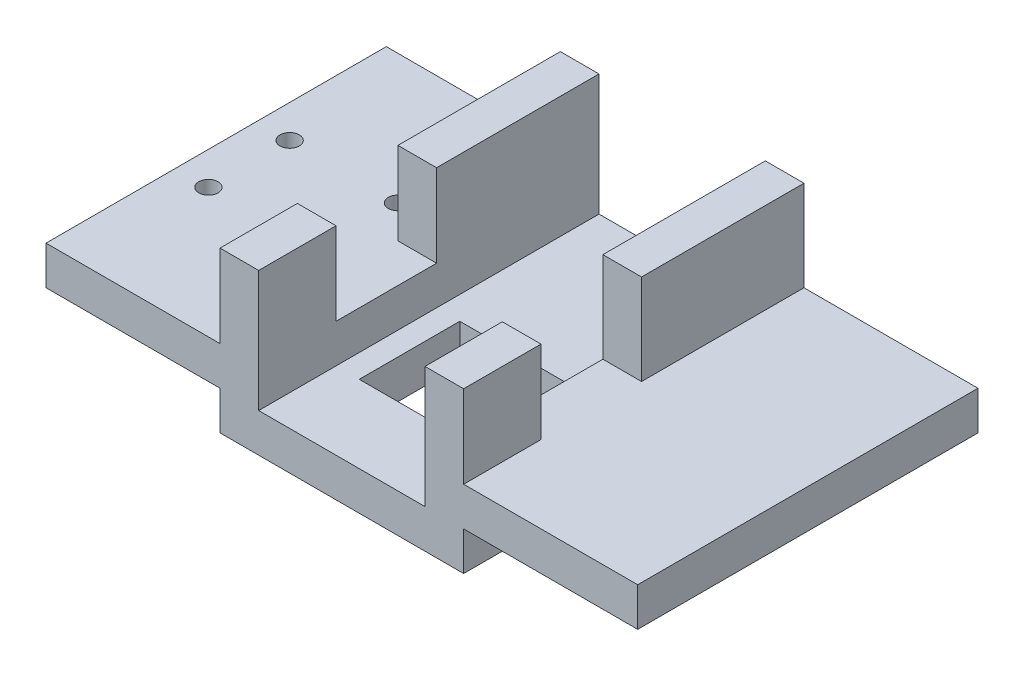
ISO-10303-21;
HEADER;
FILE_DESCRIPTION(('STEP AP214'),'2;1');
FILE_NAME('part.step','',(''),(''),'','','');
FILE_SCHEMA(('AUTOMOTIVE_DESIGN { 1 0 10303 214 1 1 1 1 }'));
ENDSEC;
DATA;
#1=APPLICATION_CONTEXT('core data for automotive mechanical design processes');
#2=APPLICATION_PROTOCOL_DEFINITION('international standard','automotive_design',2000,#1);
#3=PRODUCT_CONTEXT('',#1,'mechanical');
#4=PRODUCT('Part','Part','',(#3));
#5=PRODUCT_RELATED_PRODUCT_CATEGORY('part','',(#4));
#6=PRODUCT_DEFINITION_FORMATION('','',#4);
#7=PRODUCT_DEFINITION_CONTEXT('part definition',#1,'design');
#8=PRODUCT_DEFINITION('design','',#6,#7);
#9=PRODUCT_DEFINITION_SHAPE('','',#8);
#10=(LENGTH_UNIT() NAMED_UNIT(*) SI_UNIT(.MILLI.,.METRE.));
#11=(NAMED_UNIT(*) PLANE_ANGLE_UNIT() SI_UNIT($,.RADIAN.));
#12=(NAMED_UNIT(*) SI_UNIT($,.STERADIAN.) SOLID_ANGLE_UNIT());
#13=UNCERTAINTY_MEASURE_WITH_UNIT(LENGTH_MEASURE(1.E-05),#10,'distance_accuracy_value','');
#14=(GEOMETRIC_REPRESENTATION_CONTEXT(3) GLOBAL_UNCERTAINTY_ASSIGNED_CONTEXT((#13)) GLOBAL_UNIT_ASSIGNED_CONTEXT((#10,
#11,#12)) REPRESENTATION_CONTEXT('',''));
#15=CARTESIAN_POINT('',(0.,0.,0.));
#16=DIRECTION('',(0.,0.,1.));
#17=DIRECTION('',(1.,0.,0.));
#18=AXIS2_PLACEMENT_3D('',#15,#16,#17);
#19=CARTESIAN_POINT('',(0.,-25.5315237964784,42.));
#20=DIRECTION('',(0.,-1.,0.));
#21=DIRECTION('',(1.,0.,0.));
#22=AXIS2_PLACEMENT_3D('',#19,#20,#21);
#23=PLANE('',#22);
#24=CARTESIAN_POINT('',(-8.5,-25.5315237964784,54.5));
#25=DIRECTION('',(0.,-1.,0.));
#26=DIRECTION('',(1.,0.,0.));
#27=AXIS2_PLACEMENT_3D('',#24,#25,#26);
#28=CIRCLE('',#27,2.5);
#29=CARTESIAN_POINT('',(-5.99999999999999,-25.5315237964784,54.5));
#30=VERTEX_POINT('',#29);
#31=EDGE_CURVE('E645',#30,#30,#28,.T.);
#32=ORIENTED_EDGE('',*,*,#31,.T.);
#33=EDGE_LOOP('',(#32));
#34=FACE_BOUND('',#33,.T.);
#35=CARTESIAN_POINT('',(-8.5,-25.5315237964784,33.5));
#36=DIRECTION('',(0.,1.,0.));
#37=DIRECTION('',(-1.,0.,0.));
#38=AXIS2_PLACEMENT_3D('',#35,#36,#37);
#39=CIRCLE('',#38,2.5);
#40=CARTESIAN_POINT('',(-11.,-25.5315237964784,33.5));
#41=VERTEX_POINT('',#40);
#42=EDGE_CURVE('E601',#41,#41,#39,.T.);
#43=ORIENTED_EDGE('',*,*,#42,.F.);
#44=EDGE_LOOP('',(#43));
#45=FACE_BOUND('',#44,.T.);
#46=DIRECTION('',(0.,0.,1.));
#47=VECTOR('',#46,1.);
#48=CARTESIAN_POINT('',(0.,-25.5315237964784,88.));
#49=LINE('',#48,#47);
#50=CARTESIAN_POINT('',(0.,-25.5315237964784,68.));
#51=VERTEX_POINT('',#50);
#52=CARTESIAN_POINT('',(0.,-25.5315237964784,88.));
#53=VERTEX_POINT('',#52);
#54=EDGE_CURVE('E50',#51,#53,#49,.T.);
#55=ORIENTED_EDGE('',*,*,#54,.F.);
#56=DIRECTION('',(-1.,0.,0.));
#57=VECTOR('',#56,1.);
#58=CARTESIAN_POINT('',(10.,-25.5315237964784,68.));
#59=LINE('',#58,#57);
#60=CARTESIAN_POINT('',(10.,-25.5315237964784,68.));
#61=VERTEX_POINT('',#60);
#62=EDGE_CURVE('E268',#61,#51,#59,.T.);
#63=ORIENTED_EDGE('',*,*,#62,.F.);
#64=DIRECTION('',(0.,0.,-1.));
#65=VECTOR('',#64,1.);
#66=CARTESIAN_POINT('',(10.,-25.5315237964784,88.));
#67=LINE('',#66,#65);
#68=CARTESIAN_POINT('',(10.,-25.5315237964784,42.));
#69=VERTEX_POINT('',#68);
#70=EDGE_CURVE('E333',#61,#69,#67,.T.);
#71=ORIENTED_EDGE('',*,*,#70,.T.);
#72=DIRECTION('',(-1.,0.,0.));
#73=VECTOR('',#72,1.);
#74=CARTESIAN_POINT('',(-45.,-25.5315237964784,42.));
#75=LINE('',#74,#73);
#76=CARTESIAN_POINT('',(0.,-25.5315237964784,42.));
#77=VERTEX_POINT('',#76);
#78=EDGE_CURVE('E318',#69,#77,#75,.T.);
#79=ORIENTED_EDGE('',*,*,#78,.T.);
#80=DIRECTION('',(0.,0.,-1.));
#81=VECTOR('',#80,1.);
#82=CARTESIAN_POINT('',(0.,-25.5315237964784,42.));
#83=LINE('',#82,#81);
#84=CARTESIAN_POINT('',(0.,-25.5315237964784,0.));
#85=VERTEX_POINT('',#84);
#86=EDGE_CURVE('E11',#77,#85,#83,.T.);
#87=ORIENTED_EDGE('',*,*,#86,.T.);
#88=DIRECTION('',(-1.,0.,0.));
#89=VECTOR('',#88,1.);
#90=CARTESIAN_POINT('',(0.,-25.5315237964784,0.));
#91=LINE('',#90,#89);
#92=CARTESIAN_POINT('',(-45.,-25.5315237964784,0.));
#93=VERTEX_POINT('',#92);
#94=EDGE_CURVE('E441',#85,#93,#91,.T.);
#95=ORIENTED_EDGE('',*,*,#94,.T.);
#96=DIRECTION('',(0.,0.,-1.));
#97=VECTOR('',#96,1.);
#98=CARTESIAN_POINT('',(-45.,-25.5315237964784,42.));
#99=LINE('',#98,#97);
#100=CARTESIAN_POINT('',(-45.,-25.5315237964784,88.));
#101=VERTEX_POINT('',#100);
#102=EDGE_CURVE('E42',#101,#93,#99,.T.);
#103=ORIENTED_EDGE('',*,*,#102,.F.);
#104=DIRECTION('',(-1.,0.,0.));
#105=VECTOR('',#104,1.);
#106=CARTESIAN_POINT('',(-45.,-25.5315237964784,88.));
#107=LINE('',#106,#105);
#108=EDGE_CURVE('E331',#53,#101,#107,.T.);
#109=ORIENTED_EDGE('',*,*,#108,.F.);
#110=EDGE_LOOP('',(#55,#63,#71,#79,#87,#95,#103,#109));
#111=FACE_BOUND('',#110,.T.);
#112=CARTESIAN_POINT('',(-36.5,-25.5315237964784,54.5));
#113=DIRECTION('',(0.,1.,0.));
#114=DIRECTION('',(-1.,0.,0.));
#115=AXIS2_PLACEMENT_3D('',#112,#113,#114);
#116=CIRCLE('',#115,2.5);
#117=CARTESIAN_POINT('',(-39.,-25.5315237964784,54.5));
#118=VERTEX_POINT('',#117);
#119=EDGE_CURVE('E637',#118,#118,#116,.T.);
#120=ORIENTED_EDGE('',*,*,#119,.F.);
#121=EDGE_LOOP('',(#120));
#122=FACE_BOUND('',#121,.T.);
#123=CARTESIAN_POINT('',(-36.5,-25.5315237964784,33.5));
#124=DIRECTION('',(0.,-1.,0.));
#125=DIRECTION('',(1.,0.,0.));
#126=AXIS2_PLACEMENT_3D('',#123,#124,#125);
#127=CIRCLE('',#126,2.5);
#128=CARTESIAN_POINT('',(-34.,-25.5315237964784,33.5));
#129=VERTEX_POINT('',#128);
#130=EDGE_CURVE('E638',#129,#129,#127,.T.);
#131=ORIENTED_EDGE('',*,*,#130,.T.);
#132=EDGE_LOOP('',(#131));
#133=FACE_BOUND('',#132,.T.);
#134=ADVANCED_FACE('F33',(#34,#45,#111,#122,#133),#23,.F.);
#135=CARTESIAN_POINT('',(-45.,-35.5315237964784,42.));
#136=DIRECTION('',(0.,1.,0.));
#137=DIRECTION('',(-1.,0.,0.));
#138=AXIS2_PLACEMENT_3D('',#135,#136,#137);
#139=PLANE('',#138);
#140=CARTESIAN_POINT('',(-8.49999999999999,-35.5315237964784,54.5));
#141=DIRECTION('',(0.,1.,0.));
#142=DIRECTION('',(-1.,0.,0.));
#143=AXIS2_PLACEMENT_3D('',#140,#141,#142);
#144=CIRCLE('',#143,2.5);
#145=CARTESIAN_POINT('',(-11.,-35.5315237964784,54.5));
#146=VERTEX_POINT('',#145);
#147=EDGE_CURVE('E646',#146,#146,#144,.F.);
#148=ORIENTED_EDGE('',*,*,#147,.F.);
#149=EDGE_LOOP('',(#148));
#150=FACE_BOUND('',#149,.T.);
#151=CARTESIAN_POINT('',(-8.49999999999999,-35.5315237964784,33.5));
#152=DIRECTION('',(0.,1.,0.));
#153=DIRECTION('',(-1.,0.,0.));
#154=AXIS2_PLACEMENT_3D('',#151,#152,#153);
#155=CIRCLE('',#154,2.5);
#156=CARTESIAN_POINT('',(-11.,-35.5315237964784,33.5));
#157=VERTEX_POINT('',#156);
#158=EDGE_CURVE('E244',#157,#157,#155,.T.);
#159=ORIENTED_EDGE('',*,*,#158,.T.);
#160=EDGE_LOOP('',(#159));
#161=FACE_BOUND('',#160,.T.);
#162=DIRECTION('',(1.,0.,0.));
#163=VECTOR('',#162,1.);
#164=CARTESIAN_POINT('',(-45.,-35.5315237964784,0.));
#165=LINE('',#164,#163);
#166=CARTESIAN_POINT('',(-45.,-35.5315237964784,0.));
#167=VERTEX_POINT('',#166);
#168=CARTESIAN_POINT('',(0.,-35.5315237964784,0.));
#169=VERTEX_POINT('',#168);
#170=EDGE_CURVE('E445',#167,#169,#165,.T.);
#171=ORIENTED_EDGE('',*,*,#170,.T.);
#172=DIRECTION('',(0.,0.,-1.));
#173=VECTOR('',#172,1.);
#174=CARTESIAN_POINT('',(0.,-35.5315237964784,42.));
#175=LINE('',#174,#173);
#176=CARTESIAN_POINT('',(0.,-35.5315237964784,88.));
#177=VERTEX_POINT('',#176);
#178=EDGE_CURVE('E420',#177,#169,#175,.T.);
#179=ORIENTED_EDGE('',*,*,#178,.F.);
#180=DIRECTION('',(1.,0.,0.));
#181=VECTOR('',#180,1.);
#182=CARTESIAN_POINT('',(-45.,-35.5315237964784,88.));
#183=LINE('',#182,#181);
#184=CARTESIAN_POINT('',(-45.,-35.5315237964784,88.));
#185=VERTEX_POINT('',#184);
#186=EDGE_CURVE('E317',#185,#177,#183,.T.);
#187=ORIENTED_EDGE('',*,*,#186,.F.);
#188=DIRECTION('',(0.,0.,-1.));
#189=VECTOR('',#188,1.);
#190=CARTESIAN_POINT('',(-45.,-35.5315237964784,42.));
#191=LINE('',#190,#189);
#192=EDGE_CURVE('E423',#185,#167,#191,.T.);
#193=ORIENTED_EDGE('',*,*,#192,.T.);
#194=EDGE_LOOP('',(#171,#179,#187,#193));
#195=FACE_BOUND('',#194,.T.);
#196=CARTESIAN_POINT('',(-36.5,-35.5315237964784,54.5));
#197=DIRECTION('',(0.,1.,0.));
#198=DIRECTION('',(-1.,0.,0.));
#199=AXIS2_PLACEMENT_3D('',#196,#197,#198);
#200=CIRCLE('',#199,2.5);
#201=CARTESIAN_POINT('',(-39.,-35.5315237964784,54.5));
#202=VERTEX_POINT('',#201);
#203=EDGE_CURVE('E633',#202,#202,#200,.T.);
#204=ORIENTED_EDGE('',*,*,#203,.T.);
#205=EDGE_LOOP('',(#204));
#206=FACE_BOUND('',#205,.T.);
#207=CARTESIAN_POINT('',(-36.5,-35.5315237964784,33.5));
#208=DIRECTION('',(0.,1.,0.));
#209=DIRECTION('',(-1.,0.,0.));
#210=AXIS2_PLACEMENT_3D('',#207,#208,#209);
#211=CIRCLE('',#210,2.5);
#212=CARTESIAN_POINT('',(-39.,-35.5315237964784,33.5));
#213=VERTEX_POINT('',#212);
#214=EDGE_CURVE('E37',#213,#213,#211,.F.);
#215=ORIENTED_EDGE('',*,*,#214,.F.);
#216=EDGE_LOOP('',(#215));
#217=FACE_BOUND('',#216,.T.);
#218=ADVANCED_FACE('F520',(#150,#161,#195,#206,#217),#139,.F.);
#219=CARTESIAN_POINT('',(63.,-25.5315237964784,42.));
#220=DIRECTION('',(0.,-1.,0.));
#221=DIRECTION('',(1.,0.,0.));
#222=AXIS2_PLACEMENT_3D('',#219,#220,#221);
#223=PLANE('',#222);
#224=DIRECTION('',(-1.,0.,0.));
#225=VECTOR('',#224,1.);
#226=CARTESIAN_POINT('',(63.,-25.5315237964783,68.));
#227=LINE('',#226,#225);
#228=CARTESIAN_POINT('',(63.,-25.5315237964783,68.));
#229=VERTEX_POINT('',#228);
#230=CARTESIAN_POINT('',(53.,-25.5315237964783,68.));
#231=VERTEX_POINT('',#230);
#232=EDGE_CURVE('E228',#229,#231,#227,.T.);
#233=ORIENTED_EDGE('',*,*,#232,.F.);
#234=DIRECTION('',(0.,0.,-1.));
#235=VECTOR('',#234,1.);
#236=CARTESIAN_POINT('',(63.,-25.5315237964783,88.));
#237=LINE('',#236,#235);
#238=CARTESIAN_POINT('',(63.,-25.5315237964783,88.));
#239=VERTEX_POINT('',#238);
#240=EDGE_CURVE('E237',#239,#229,#237,.T.);
#241=ORIENTED_EDGE('',*,*,#240,.F.);
#242=DIRECTION('',(-1.,0.,0.));
#243=VECTOR('',#242,1.);
#244=CARTESIAN_POINT('',(53.,-25.5315237964784,88.));
#245=LINE('',#244,#243);
#246=CARTESIAN_POINT('',(108.,-25.5315237964784,88.));
#247=VERTEX_POINT('',#246);
#248=EDGE_CURVE('E301',#247,#239,#245,.T.);
#249=ORIENTED_EDGE('',*,*,#248,.F.);
#250=DIRECTION('',(0.,0.,-1.));
#251=VECTOR('',#250,1.);
#252=CARTESIAN_POINT('',(108.,-25.5315237964784,42.));
#253=LINE('',#252,#251);
#254=CARTESIAN_POINT('',(108.,-25.5315237964784,0.));
#255=VERTEX_POINT('',#254);
#256=EDGE_CURVE('E405',#247,#255,#253,.T.);
#257=ORIENTED_EDGE('',*,*,#256,.T.);
#258=DIRECTION('',(-1.,0.,0.));
#259=VECTOR('',#258,1.);
#260=CARTESIAN_POINT('',(63.,-25.5315237964784,0.));
#261=LINE('',#260,#259);
#262=CARTESIAN_POINT('',(63.,-25.5315237964784,0.));
#263=VERTEX_POINT('',#262);
#264=EDGE_CURVE('E457',#255,#263,#261,.T.);
#265=ORIENTED_EDGE('',*,*,#264,.T.);
#266=DIRECTION('',(0.,0.,-1.));
#267=VECTOR('',#266,1.);
#268=CARTESIAN_POINT('',(63.,-25.5315237964784,42.));
#269=LINE('',#268,#267);
#270=CARTESIAN_POINT('',(63.,-25.5315237964784,42.));
#271=VERTEX_POINT('',#270);
#272=EDGE_CURVE('E402',#271,#263,#269,.T.);
#273=ORIENTED_EDGE('',*,*,#272,.F.);
#274=DIRECTION('',(-1.,0.,0.));
#275=VECTOR('',#274,1.);
#276=CARTESIAN_POINT('',(53.,-25.5315237964784,42.));
#277=LINE('',#276,#275);
#278=CARTESIAN_POINT('',(53.,-25.5315237964784,42.));
#279=VERTEX_POINT('',#278);
#280=EDGE_CURVE('E288',#271,#279,#277,.T.);
#281=ORIENTED_EDGE('',*,*,#280,.T.);
#282=DIRECTION('',(0.,0.,-1.));
#283=VECTOR('',#282,1.);
#284=CARTESIAN_POINT('',(53.,-25.5315237964784,88.));
#285=LINE('',#284,#283);
#286=EDGE_CURVE('E248',#231,#279,#285,.T.);
#287=ORIENTED_EDGE('',*,*,#286,.F.);
#288=EDGE_LOOP('',(#233,#241,#249,#257,#265,#273,#281,#287));
#289=FACE_BOUND('',#288,.T.);
#290=ADVANCED_FACE('F246',(#289),#223,.F.);
#291=CARTESIAN_POINT('',(16.,-45.5315237964784,88.));
#292=DIRECTION('',(-1.,0.,0.));
#293=DIRECTION('',(0.,0.,1.));
#294=AXIS2_PLACEMENT_3D('',#291,#292,#293);
#295=PLANE('',#294);
#296=DIRECTION('',(0.,-1.,0.));
#297=VECTOR('',#296,1.);
#298=CARTESIAN_POINT('',(16.,-35.5315237964784,68.));
#299=LINE('',#298,#297);
#300=CARTESIAN_POINT('',(16.,-35.5315237964784,68.));
#301=VERTEX_POINT('',#300);
#302=CARTESIAN_POINT('',(16.,-45.5315237964784,68.));
#303=VERTEX_POINT('',#302);
#304=EDGE_CURVE('E285',#301,#303,#299,.T.);
#305=ORIENTED_EDGE('',*,*,#304,.T.);
#306=DIRECTION('',(0.,0.,-1.));
#307=VECTOR('',#306,1.);
#308=CARTESIAN_POINT('',(16.,-45.5315237964784,88.));
#309=LINE('',#308,#307);
#310=CARTESIAN_POINT('',(16.,-45.5315237964784,42.));
#311=VERTEX_POINT('',#310);
#312=EDGE_CURVE('E353',#303,#311,#309,.T.);
#313=ORIENTED_EDGE('',*,*,#312,.T.);
#314=DIRECTION('',(0.,1.,0.));
#315=VECTOR('',#314,1.);
#316=CARTESIAN_POINT('',(16.,-45.5315237964784,42.));
#317=LINE('',#316,#315);
#318=CARTESIAN_POINT('',(16.,-35.5315237964784,42.));
#319=VERTEX_POINT('',#318);
#320=EDGE_CURVE('E313',#311,#319,#317,.T.);
#321=ORIENTED_EDGE('',*,*,#320,.T.);
#322=DIRECTION('',(0.,0.,-1.));
#323=VECTOR('',#322,1.);
#324=CARTESIAN_POINT('',(16.,-35.5315237964784,88.));
#325=LINE('',#324,#323);
#326=EDGE_CURVE('E350',#301,#319,#325,.T.);
#327=ORIENTED_EDGE('',*,*,#326,.F.);
#328=EDGE_LOOP('',(#305,#313,#321,#327));
#329=FACE_BOUND('',#328,.T.);
#330=ADVANCED_FACE('F495',(#329),#295,.F.);
#331=CARTESIAN_POINT('',(47.,-45.5315237964784,88.));
#332=DIRECTION('',(1.,0.,0.));
#333=DIRECTION('',(0.,0.,-1.));
#334=AXIS2_PLACEMENT_3D('',#331,#332,#333);
#335=PLANE('',#334);
#336=DIRECTION('',(0.,-1.,0.));
#337=VECTOR('',#336,1.);
#338=CARTESIAN_POINT('',(47.,-35.5315237964784,68.));
#339=LINE('',#338,#337);
#340=CARTESIAN_POINT('',(47.,-35.5315237964784,68.));
#341=VERTEX_POINT('',#340);
#342=CARTESIAN_POINT('',(47.,-45.5315237964784,68.));
#343=VERTEX_POINT('',#342);
#344=EDGE_CURVE('E281',#341,#343,#339,.T.);
#345=ORIENTED_EDGE('',*,*,#344,.F.);
#346=DIRECTION('',(0.,0.,-1.));
#347=VECTOR('',#346,1.);
#348=CARTESIAN_POINT('',(47.,-35.5315237964784,88.));
#349=LINE('',#348,#347);
#350=CARTESIAN_POINT('',(47.,-35.5315237964784,42.));
#351=VERTEX_POINT('',#350);
#352=EDGE_CURVE('E310',#341,#351,#349,.T.);
#353=ORIENTED_EDGE('',*,*,#352,.T.);
#354=DIRECTION('',(0.,-1.,0.));
#355=VECTOR('',#354,1.);
#356=CARTESIAN_POINT('',(47.,-45.5315237964784,42.));
#357=LINE('',#356,#355);
#358=CARTESIAN_POINT('',(47.,-45.5315237964784,42.));
#359=VERTEX_POINT('',#358);
#360=EDGE_CURVE('E295',#351,#359,#357,.T.);
#361=ORIENTED_EDGE('',*,*,#360,.T.);
#362=DIRECTION('',(0.,0.,-1.));
#363=VECTOR('',#362,1.);
#364=CARTESIAN_POINT('',(47.,-45.5315237964784,88.));
#365=LINE('',#364,#363);
#366=EDGE_CURVE('E58',#343,#359,#365,.T.);
#367=ORIENTED_EDGE('',*,*,#366,.F.);
#368=EDGE_LOOP('',(#345,#353,#361,#367));
#369=FACE_BOUND('',#368,.T.);
#370=ADVANCED_FACE('F501',(#369),#335,.F.);
#371=CARTESIAN_POINT('',(0.,0.,42.));
#372=DIRECTION('',(0.,0.,-1.));
#373=DIRECTION('',(-1.,0.,0.));
#374=AXIS2_PLACEMENT_3D('',#371,#372,#373);
#375=PLANE('',#374);
#376=ORIENTED_EDGE('',*,*,#280,.F.);
#377=DIRECTION('',(0.,1.,0.));
#378=VECTOR('',#377,1.);
#379=CARTESIAN_POINT('',(63.,-2.11332143909236,42.));
#380=LINE('',#379,#378);
#381=CARTESIAN_POINT('',(63.,-2.11332143909236,42.));
#382=VERTEX_POINT('',#381);
#383=EDGE_CURVE('E373',#271,#382,#380,.T.);
#384=ORIENTED_EDGE('',*,*,#383,.T.);
#385=DIRECTION('',(-1.,0.,0.));
#386=VECTOR('',#385,1.);
#387=CARTESIAN_POINT('',(53.,-2.11332143909236,42.));
#388=LINE('',#387,#386);
#389=CARTESIAN_POINT('',(53.,-2.11332143909236,42.));
#390=VERTEX_POINT('',#389);
#391=EDGE_CURVE('E431',#382,#390,#388,.T.);
#392=ORIENTED_EDGE('',*,*,#391,.T.);
#393=DIRECTION('',(0.,-1.,0.));
#394=VECTOR('',#393,1.);
#395=CARTESIAN_POINT('',(53.,-35.5315237964784,42.));
#396=LINE('',#395,#394);
#397=EDGE_CURVE('E433',#390,#279,#396,.T.);
#398=ORIENTED_EDGE('',*,*,#397,.T.);
#399=EDGE_LOOP('',(#376,#384,#392,#398));
#400=FACE_BOUND('',#399,.T.);
#401=ADVANCED_FACE('F576',(#400),#375,.F.);
#402=ORIENTED_EDGE('',*,*,#360,.F.);
#403=DIRECTION('',(-1.,0.,0.));
#404=VECTOR('',#403,1.);
#405=CARTESIAN_POINT('',(10.,-35.5315237964784,42.));
#406=LINE('',#405,#404);
#407=EDGE_CURVE('E354',#351,#319,#406,.T.);
#408=ORIENTED_EDGE('',*,*,#407,.T.);
#409=ORIENTED_EDGE('',*,*,#320,.F.);
#410=DIRECTION('',(1.,0.,0.));
#411=VECTOR('',#410,1.);
#412=CARTESIAN_POINT('',(63.,-45.5315237964784,42.));
#413=LINE('',#412,#411);
#414=EDGE_CURVE('E367',#311,#359,#413,.T.);
#415=ORIENTED_EDGE('',*,*,#414,.T.);
#416=EDGE_LOOP('',(#402,#408,#409,#415));
#417=FACE_BOUND('',#416,.T.);
#418=ADVANCED_FACE('F490',(#417),#375,.F.);
#419=ORIENTED_EDGE('',*,*,#78,.F.);
#420=DIRECTION('',(0.,1.,0.));
#421=VECTOR('',#420,1.);
#422=CARTESIAN_POINT('',(10.,-4.14436549233106,42.));
#423=LINE('',#422,#421);
#424=CARTESIAN_POINT('',(10.,-4.14436549233106,42.));
#425=VERTEX_POINT('',#424);
#426=EDGE_CURVE('E342',#69,#425,#423,.T.);
#427=ORIENTED_EDGE('',*,*,#426,.T.);
#428=DIRECTION('',(-1.,0.,0.));
#429=VECTOR('',#428,1.);
#430=CARTESIAN_POINT('',(0.,-4.14436549233106,42.));
#431=LINE('',#430,#429);
#432=CARTESIAN_POINT('',(0.,-4.14436549233106,42.));
#433=VERTEX_POINT('',#432);
#434=EDGE_CURVE('E388',#425,#433,#431,.T.);
#435=ORIENTED_EDGE('',*,*,#434,.T.);
#436=DIRECTION('',(0.,-1.,0.));
#437=VECTOR('',#436,1.);
#438=CARTESIAN_POINT('',(0.,-4.14436549233106,42.));
#439=LINE('',#438,#437);
#440=EDGE_CURVE('E366',#433,#77,#439,.T.);
#441=ORIENTED_EDGE('',*,*,#440,.T.);
#442=EDGE_LOOP('',(#419,#427,#435,#441));
#443=FACE_BOUND('',#442,.T.);
#444=ADVANCED_FACE('F482',(#443),#375,.F.);
#445=CARTESIAN_POINT('',(0.,-4.14436549233106,42.));
#446=DIRECTION('',(1.,0.,0.));
#447=DIRECTION('',(0.,1.,0.));
#448=AXIS2_PLACEMENT_3D('',#445,#446,#447);
#449=PLANE('',#448);
#450=DIRECTION('',(0.,-1.,0.));
#451=VECTOR('',#450,1.);
#452=CARTESIAN_POINT('',(0.,-4.14436549233106,0.));
#453=LINE('',#452,#451);
#454=CARTESIAN_POINT('',(0.,-4.14436549233106,0.));
#455=VERTEX_POINT('',#454);
#456=EDGE_CURVE('E358',#455,#85,#453,.T.);
#457=ORIENTED_EDGE('',*,*,#456,.T.);
#458=ORIENTED_EDGE('',*,*,#86,.F.);
#459=ORIENTED_EDGE('',*,*,#440,.F.);
#460=DIRECTION('',(0.,0.,-1.));
#461=VECTOR('',#460,1.);
#462=CARTESIAN_POINT('',(0.,-4.14436549233106,42.));
#463=LINE('',#462,#461);
#464=EDGE_CURVE('E385',#433,#455,#463,.T.);
#465=ORIENTED_EDGE('',*,*,#464,.T.);
#466=EDGE_LOOP('',(#457,#458,#459,#465));
#467=FACE_BOUND('',#466,.T.);
#468=ADVANCED_FACE('F35',(#467),#449,.F.);
#469=CARTESIAN_POINT('',(-45.,-25.5315237964784,42.));
#470=DIRECTION('',(1.,0.,0.));
#471=DIRECTION('',(0.,0.,-1.));
#472=AXIS2_PLACEMENT_3D('',#469,#470,#471);
#473=PLANE('',#472);
#474=DIRECTION('',(0.,-1.,0.));
#475=VECTOR('',#474,1.);
#476=CARTESIAN_POINT('',(-45.,-25.5315237964784,0.));
#477=LINE('',#476,#475);
#478=EDGE_CURVE('E443',#93,#167,#477,.T.);
#479=ORIENTED_EDGE('',*,*,#478,.T.);
#480=ORIENTED_EDGE('',*,*,#192,.F.);
#481=DIRECTION('',(0.,-1.,0.));
#482=VECTOR('',#481,1.);
#483=CARTESIAN_POINT('',(-45.,-25.5315237964784,88.));
#484=LINE('',#483,#482);
#485=EDGE_CURVE('E314',#101,#185,#484,.T.);
#486=ORIENTED_EDGE('',*,*,#485,.F.);
#487=ORIENTED_EDGE('',*,*,#102,.T.);
#488=EDGE_LOOP('',(#479,#480,#486,#487));
#489=FACE_BOUND('',#488,.T.);
#490=ADVANCED_FACE('F530',(#489),#473,.F.);
#491=CARTESIAN_POINT('',(0.,-35.5315237964784,42.));
#492=DIRECTION('',(1.,0.,0.));
#493=DIRECTION('',(0.,1.,0.));
#494=AXIS2_PLACEMENT_3D('',#491,#492,#493);
#495=PLANE('',#494);
#496=DIRECTION('',(0.,-1.,0.));
#497=VECTOR('',#496,1.);
#498=CARTESIAN_POINT('',(0.,-35.5315237964784,0.));
#499=LINE('',#498,#497);
#500=CARTESIAN_POINT('',(0.,-45.5315237964784,0.));
#501=VERTEX_POINT('',#500);
#502=EDGE_CURVE('E447',#169,#501,#499,.T.);
#503=ORIENTED_EDGE('',*,*,#502,.T.);
#504=DIRECTION('',(0.,0.,-1.));
#505=VECTOR('',#504,1.);
#506=CARTESIAN_POINT('',(0.,-45.5315237964784,42.));
#507=LINE('',#506,#505);
#508=CARTESIAN_POINT('',(0.,-45.5315237964784,88.));
#509=VERTEX_POINT('',#508);
#510=EDGE_CURVE('E417',#509,#501,#507,.T.);
#511=ORIENTED_EDGE('',*,*,#510,.F.);
#512=DIRECTION('',(0.,-1.,0.));
#513=VECTOR('',#512,1.);
#514=CARTESIAN_POINT('',(0.,-35.5315237964784,88.));
#515=LINE('',#514,#513);
#516=EDGE_CURVE('E321',#177,#509,#515,.T.);
#517=ORIENTED_EDGE('',*,*,#516,.F.);
#518=ORIENTED_EDGE('',*,*,#178,.T.);
#519=EDGE_LOOP('',(#503,#511,#517,#518));
#520=FACE_BOUND('',#519,.T.);
#521=ADVANCED_FACE('F532',(#520),#495,.F.);
#522=CARTESIAN_POINT('',(63.,-45.5315237964784,42.));
#523=DIRECTION('',(0.,1.,0.));
#524=DIRECTION('',(-1.,0.,0.));
#525=AXIS2_PLACEMENT_3D('',#522,#523,#524);
#526=PLANE('',#525);
#527=ORIENTED_EDGE('',*,*,#312,.F.);
#528=DIRECTION('',(1.,0.,0.));
#529=VECTOR('',#528,1.);
#530=CARTESIAN_POINT('',(-6.36067977499789,-45.5315237964784,68.));
#531=LINE('',#530,#529);
#532=EDGE_CURVE('E284',#303,#343,#531,.T.);
#533=ORIENTED_EDGE('',*,*,#532,.T.);
#534=ORIENTED_EDGE('',*,*,#366,.T.);
#535=ORIENTED_EDGE('',*,*,#414,.F.);
#536=EDGE_LOOP('',(#527,#533,#534,#535));
#537=FACE_BOUND('',#536,.T.);
#538=DIRECTION('',(1.,0.,0.));
#539=VECTOR('',#538,1.);
#540=CARTESIAN_POINT('',(63.,-45.5315237964784,0.));
#541=LINE('',#540,#539);
#542=CARTESIAN_POINT('',(63.,-45.5315237964784,0.));
#543=VERTEX_POINT('',#542);
#544=EDGE_CURVE('E449',#501,#543,#541,.T.);
#545=ORIENTED_EDGE('',*,*,#544,.T.);
#546=DIRECTION('',(0.,0.,-1.));
#547=VECTOR('',#546,1.);
#548=CARTESIAN_POINT('',(63.,-45.5315237964784,42.));
#549=LINE('',#548,#547);
#550=CARTESIAN_POINT('',(63.,-45.5315237964784,88.));
#551=VERTEX_POINT('',#550);
#552=EDGE_CURVE('E414',#551,#543,#549,.T.);
#553=ORIENTED_EDGE('',*,*,#552,.F.);
#554=DIRECTION('',(1.,0.,0.));
#555=VECTOR('',#554,1.);
#556=CARTESIAN_POINT('',(0.,-45.5315237964784,88.));
#557=LINE('',#556,#555);
#558=EDGE_CURVE('E324',#509,#551,#557,.T.);
#559=ORIENTED_EDGE('',*,*,#558,.F.);
#560=ORIENTED_EDGE('',*,*,#510,.T.);
#561=EDGE_LOOP('',(#545,#553,#559,#560));
#562=FACE_BOUND('',#561,.T.);
#563=ADVANCED_FACE('F497',(#537,#562),#526,.F.);
#564=CARTESIAN_POINT('',(63.,-35.5315237964784,42.));
#565=DIRECTION('',(-1.,0.,0.));
#566=DIRECTION('',(0.,0.,1.));
#567=AXIS2_PLACEMENT_3D('',#564,#565,#566);
#568=PLANE('',#567);
#569=DIRECTION('',(0.,1.,0.));
#570=VECTOR('',#569,1.);
#571=CARTESIAN_POINT('',(63.,-35.5315237964784,0.));
#572=LINE('',#571,#570);
#573=CARTESIAN_POINT('',(63.,-35.5315237964784,0.));
#574=VERTEX_POINT('',#573);
#575=EDGE_CURVE('E451',#543,#574,#572,.T.);
#576=ORIENTED_EDGE('',*,*,#575,.T.);
#577=DIRECTION('',(0.,0.,-1.));
#578=VECTOR('',#577,1.);
#579=CARTESIAN_POINT('',(63.,-35.5315237964784,42.));
#580=LINE('',#579,#578);
#581=CARTESIAN_POINT('',(63.,-35.5315237964784,88.));
#582=VERTEX_POINT('',#581);
#583=EDGE_CURVE('E411',#582,#574,#580,.T.);
#584=ORIENTED_EDGE('',*,*,#583,.F.);
#585=DIRECTION('',(0.,1.,0.));
#586=VECTOR('',#585,1.);
#587=CARTESIAN_POINT('',(63.,-35.5315237964784,88.));
#588=LINE('',#587,#586);
#589=EDGE_CURVE('E291',#551,#582,#588,.T.);
#590=ORIENTED_EDGE('',*,*,#589,.F.);
#591=ORIENTED_EDGE('',*,*,#552,.T.);
#592=EDGE_LOOP('',(#576,#584,#590,#591));
#593=FACE_BOUND('',#592,.T.);
#594=ADVANCED_FACE('F540',(#593),#568,.F.);
#595=CARTESIAN_POINT('',(108.,-35.5315237964784,42.));
#596=DIRECTION('',(0.,1.,0.));
#597=DIRECTION('',(0.,0.,1.));
#598=AXIS2_PLACEMENT_3D('',#595,#596,#597);
#599=PLANE('',#598);
#600=DIRECTION('',(1.,0.,0.));
#601=VECTOR('',#600,1.);
#602=CARTESIAN_POINT('',(108.,-35.5315237964784,0.));
#603=LINE('',#602,#601);
#604=CARTESIAN_POINT('',(108.,-35.5315237964784,0.));
#605=VERTEX_POINT('',#604);
#606=EDGE_CURVE('E453',#574,#605,#603,.T.);
#607=ORIENTED_EDGE('',*,*,#606,.T.);
#608=DIRECTION('',(0.,0.,-1.));
#609=VECTOR('',#608,1.);
#610=CARTESIAN_POINT('',(108.,-35.5315237964784,42.));
#611=LINE('',#610,#609);
#612=CARTESIAN_POINT('',(108.,-35.5315237964784,88.));
#613=VERTEX_POINT('',#612);
#614=EDGE_CURVE('E408',#613,#605,#611,.T.);
#615=ORIENTED_EDGE('',*,*,#614,.F.);
#616=DIRECTION('',(1.,0.,0.));
#617=VECTOR('',#616,1.);
#618=CARTESIAN_POINT('',(63.,-35.5315237964784,88.));
#619=LINE('',#618,#617);
#620=EDGE_CURVE('E294',#582,#613,#619,.T.);
#621=ORIENTED_EDGE('',*,*,#620,.F.);
#622=ORIENTED_EDGE('',*,*,#583,.T.);
#623=EDGE_LOOP('',(#607,#615,#621,#622));
#624=FACE_BOUND('',#623,.T.);
#625=ADVANCED_FACE('F543',(#624),#599,.F.);
#626=CARTESIAN_POINT('',(108.,-25.5315237964784,42.));
#627=DIRECTION('',(-1.,0.,0.));
#628=DIRECTION('',(0.,0.,1.));
#629=AXIS2_PLACEMENT_3D('',#626,#627,#628);
#630=PLANE('',#629);
#631=DIRECTION('',(0.,1.,0.));
#632=VECTOR('',#631,1.);
#633=CARTESIAN_POINT('',(108.,-25.5315237964784,0.));
#634=LINE('',#633,#632);
#635=EDGE_CURVE('E455',#605,#255,#634,.T.);
#636=ORIENTED_EDGE('',*,*,#635,.T.);
#637=ORIENTED_EDGE('',*,*,#256,.F.);
#638=DIRECTION('',(0.,1.,0.));
#639=VECTOR('',#638,1.);
#640=CARTESIAN_POINT('',(108.,-25.5315237964784,88.));
#641=LINE('',#640,#639);
#642=EDGE_CURVE('E298',#613,#247,#641,.T.);
#643=ORIENTED_EDGE('',*,*,#642,.F.);
#644=ORIENTED_EDGE('',*,*,#614,.T.);
#645=EDGE_LOOP('',(#636,#637,#643,#644));
#646=FACE_BOUND('',#645,.T.);
#647=ADVANCED_FACE('F547',(#646),#630,.F.);
#648=CARTESIAN_POINT('',(63.,-2.11332143909236,42.));
#649=DIRECTION('',(-1.,0.,0.));
#650=DIRECTION('',(0.,0.,1.));
#651=AXIS2_PLACEMENT_3D('',#648,#649,#650);
#652=PLANE('',#651);
#653=DIRECTION('',(0.,1.,0.));
#654=VECTOR('',#653,1.);
#655=CARTESIAN_POINT('',(63.,-2.11332143909236,0.));
#656=LINE('',#655,#654);
#657=CARTESIAN_POINT('',(63.,-2.11332143909236,0.));
#658=VERTEX_POINT('',#657);
#659=EDGE_CURVE('E459',#263,#658,#656,.T.);
#660=ORIENTED_EDGE('',*,*,#659,.T.);
#661=DIRECTION('',(0.,0.,-1.));
#662=VECTOR('',#661,1.);
#663=CARTESIAN_POINT('',(63.,-2.11332143909236,42.));
#664=LINE('',#663,#662);
#665=EDGE_CURVE('E399',#382,#658,#664,.T.);
#666=ORIENTED_EDGE('',*,*,#665,.F.);
#667=ORIENTED_EDGE('',*,*,#383,.F.);
#668=ORIENTED_EDGE('',*,*,#272,.T.);
#669=EDGE_LOOP('',(#660,#666,#667,#668));
#670=FACE_BOUND('',#669,.T.);
#671=ADVANCED_FACE('F551',(#670),#652,.F.);
#672=CARTESIAN_POINT('',(53.,-2.11332143909236,42.));
#673=DIRECTION('',(0.,-1.,0.));
#674=DIRECTION('',(0.,0.,-1.));
#675=AXIS2_PLACEMENT_3D('',#672,#673,#674);
#676=PLANE('',#675);
#677=DIRECTION('',(-1.,0.,0.));
#678=VECTOR('',#677,1.);
#679=CARTESIAN_POINT('',(53.,-2.11332143909236,0.));
#680=LINE('',#679,#678);
#681=CARTESIAN_POINT('',(53.,-2.11332143909236,0.));
#682=VERTEX_POINT('',#681);
#683=EDGE_CURVE('E461',#658,#682,#680,.T.);
#684=ORIENTED_EDGE('',*,*,#683,.T.);
#685=DIRECTION('',(0.,0.,-1.));
#686=VECTOR('',#685,1.);
#687=CARTESIAN_POINT('',(53.,-2.11332143909236,42.));
#688=LINE('',#687,#686);
#689=EDGE_CURVE('E396',#390,#682,#688,.T.);
#690=ORIENTED_EDGE('',*,*,#689,.F.);
#691=ORIENTED_EDGE('',*,*,#391,.F.);
#692=ORIENTED_EDGE('',*,*,#665,.T.);
#693=EDGE_LOOP('',(#684,#690,#691,#692));
#694=FACE_BOUND('',#693,.T.);
#695=ADVANCED_FACE('F557',(#694),#676,.F.);
#696=CARTESIAN_POINT('',(53.,-35.5315237964784,42.));
#697=DIRECTION('',(1.,0.,0.));
#698=DIRECTION('',(0.,0.,-1.));
#699=AXIS2_PLACEMENT_3D('',#696,#697,#698);
#700=PLANE('',#699);
#701=DIRECTION('',(0.,-1.,0.));
#702=VECTOR('',#701,1.);
#703=CARTESIAN_POINT('',(53.,-35.5315237964784,0.));
#704=LINE('',#703,#702);
#705=CARTESIAN_POINT('',(53.,-35.5315237964784,0.));
#706=VERTEX_POINT('',#705);
#707=EDGE_CURVE('E463',#682,#706,#704,.T.);
#708=ORIENTED_EDGE('',*,*,#707,.T.);
#709=DIRECTION('',(0.,0.,-1.));
#710=VECTOR('',#709,1.);
#711=CARTESIAN_POINT('',(53.,-35.5315237964784,42.));
#712=LINE('',#711,#710);
#713=CARTESIAN_POINT('',(53.,-35.5315237964784,88.));
#714=VERTEX_POINT('',#713);
#715=EDGE_CURVE('E393',#714,#706,#712,.T.);
#716=ORIENTED_EDGE('',*,*,#715,.F.);
#717=DIRECTION('',(0.,-1.,0.));
#718=VECTOR('',#717,1.);
#719=CARTESIAN_POINT('',(53.,-35.5315237964784,88.));
#720=LINE('',#719,#718);
#721=CARTESIAN_POINT('',(53.,-4.14436549233106,88.));
#722=VERTEX_POINT('',#721);
#723=EDGE_CURVE('E303',#722,#714,#720,.T.);
#724=ORIENTED_EDGE('',*,*,#723,.F.);
#725=DIRECTION('',(0.,0.,-1.));
#726=VECTOR('',#725,1.);
#727=CARTESIAN_POINT('',(53.,-4.14436549233106,88.));
#728=LINE('',#727,#726);
#729=CARTESIAN_POINT('',(53.,-4.14436549233106,68.));
#730=VERTEX_POINT('',#729);
#731=EDGE_CURVE('E256',#722,#730,#728,.T.);
#732=ORIENTED_EDGE('',*,*,#731,.T.);
#733=DIRECTION('',(0.,-1.,0.));
#734=VECTOR('',#733,1.);
#735=CARTESIAN_POINT('',(53.,18.2163142826668,68.));
#736=LINE('',#735,#734);
#737=EDGE_CURVE('E234',#730,#231,#736,.T.);
#738=ORIENTED_EDGE('',*,*,#737,.T.);
#739=ORIENTED_EDGE('',*,*,#286,.T.);
#740=ORIENTED_EDGE('',*,*,#397,.F.);
#741=ORIENTED_EDGE('',*,*,#689,.T.);
#742=EDGE_LOOP('',(#708,#716,#724,#732,#738,#739,#740,#741));
#743=FACE_BOUND('',#742,.T.);
#744=ADVANCED_FACE('F561',(#743),#700,.F.);
#745=CARTESIAN_POINT('',(10.,-35.5315237964784,42.));
#746=DIRECTION('',(0.,-1.,0.));
#747=DIRECTION('',(1.,0.,0.));
#748=AXIS2_PLACEMENT_3D('',#745,#746,#747);
#749=PLANE('',#748);
#750=DIRECTION('',(1.,0.,0.));
#751=VECTOR('',#750,1.);
#752=CARTESIAN_POINT('',(-6.36067977499789,-35.5315237964784,68.));
#753=LINE('',#752,#751);
#754=EDGE_CURVE('E267',#301,#341,#753,.T.);
#755=ORIENTED_EDGE('',*,*,#754,.F.);
#756=ORIENTED_EDGE('',*,*,#326,.T.);
#757=ORIENTED_EDGE('',*,*,#407,.F.);
#758=ORIENTED_EDGE('',*,*,#352,.F.);
#759=EDGE_LOOP('',(#755,#756,#757,#758));
#760=FACE_BOUND('',#759,.T.);
#761=DIRECTION('',(-1.,0.,0.));
#762=VECTOR('',#761,1.);
#763=CARTESIAN_POINT('',(10.,-35.5315237964784,0.));
#764=LINE('',#763,#762);
#765=CARTESIAN_POINT('',(10.,-35.5315237964784,0.));
#766=VERTEX_POINT('',#765);
#767=EDGE_CURVE('E381',#706,#766,#764,.T.);
#768=ORIENTED_EDGE('',*,*,#767,.T.);
#769=DIRECTION('',(0.,0.,-1.));
#770=VECTOR('',#769,1.);
#771=CARTESIAN_POINT('',(10.,-35.5315237964784,42.));
#772=LINE('',#771,#770);
#773=CARTESIAN_POINT('',(10.,-35.5315237964784,88.));
#774=VERTEX_POINT('',#773);
#775=EDGE_CURVE('E390',#774,#766,#772,.T.);
#776=ORIENTED_EDGE('',*,*,#775,.F.);
#777=DIRECTION('',(-1.,0.,0.));
#778=VECTOR('',#777,1.);
#779=CARTESIAN_POINT('',(16.,-35.5315237964784,88.));
#780=LINE('',#779,#778);
#781=EDGE_CURVE('E326',#714,#774,#780,.T.);
#782=ORIENTED_EDGE('',*,*,#781,.F.);
#783=ORIENTED_EDGE('',*,*,#715,.T.);
#784=EDGE_LOOP('',(#768,#776,#782,#783));
#785=FACE_BOUND('',#784,.T.);
#786=ADVANCED_FACE('F466',(#760,#785),#749,.F.);
#787=CARTESIAN_POINT('',(10.,-4.14436549233106,42.));
#788=DIRECTION('',(-1.,0.,0.));
#789=DIRECTION('',(0.,-1.,0.));
#790=AXIS2_PLACEMENT_3D('',#787,#788,#789);
#791=PLANE('',#790);
#792=DIRECTION('',(0.,1.,0.));
#793=VECTOR('',#792,1.);
#794=CARTESIAN_POINT('',(10.,-4.14436549233106,0.));
#795=LINE('',#794,#793);
#796=CARTESIAN_POINT('',(10.,-4.14436549233106,0.));
#797=VERTEX_POINT('',#796);
#798=EDGE_CURVE('E374',#766,#797,#795,.T.);
#799=ORIENTED_EDGE('',*,*,#798,.T.);
#800=DIRECTION('',(0.,0.,-1.));
#801=VECTOR('',#800,1.);
#802=CARTESIAN_POINT('',(10.,-4.14436549233106,42.));
#803=LINE('',#802,#801);
#804=EDGE_CURVE('E387',#425,#797,#803,.T.);
#805=ORIENTED_EDGE('',*,*,#804,.F.);
#806=ORIENTED_EDGE('',*,*,#426,.F.);
#807=ORIENTED_EDGE('',*,*,#70,.F.);
#808=DIRECTION('',(0.,-1.,0.));
#809=VECTOR('',#808,1.);
#810=CARTESIAN_POINT('',(9.99999999999999,18.2163142826668,68.));
#811=LINE('',#810,#809);
#812=CARTESIAN_POINT('',(10.,-4.14436549233106,68.));
#813=VERTEX_POINT('',#812);
#814=EDGE_CURVE('E277',#813,#61,#811,.T.);
#815=ORIENTED_EDGE('',*,*,#814,.F.);
#816=DIRECTION('',(0.,0.,1.));
#817=VECTOR('',#816,1.);
#818=CARTESIAN_POINT('',(10.,-4.14436549233106,88.));
#819=LINE('',#818,#817);
#820=CARTESIAN_POINT('',(10.,-4.14436549233106,88.));
#821=VERTEX_POINT('',#820);
#822=EDGE_CURVE('E264',#813,#821,#819,.T.);
#823=ORIENTED_EDGE('',*,*,#822,.T.);
#824=DIRECTION('',(0.,1.,0.));
#825=VECTOR('',#824,1.);
#826=CARTESIAN_POINT('',(10.,-35.5315237964784,88.));
#827=LINE('',#826,#825);
#828=EDGE_CURVE('E329',#774,#821,#827,.T.);
#829=ORIENTED_EDGE('',*,*,#828,.F.);
#830=ORIENTED_EDGE('',*,*,#775,.T.);
#831=EDGE_LOOP('',(#799,#805,#806,#807,#815,#823,#829,#830));
#832=FACE_BOUND('',#831,.T.);
#833=ADVANCED_FACE('F473',(#832),#791,.F.);
#834=CARTESIAN_POINT('',(0.,-4.14436549233106,42.));
#835=DIRECTION('',(0.,-1.,0.));
#836=DIRECTION('',(0.,0.,-1.));
#837=AXIS2_PLACEMENT_3D('',#834,#835,#836);
#838=PLANE('',#837);
#839=DIRECTION('',(-1.,0.,0.));
#840=VECTOR('',#839,1.);
#841=CARTESIAN_POINT('',(0.,-4.14436549233106,0.));
#842=LINE('',#841,#840);
#843=EDGE_CURVE('E368',#797,#455,#842,.T.);
#844=ORIENTED_EDGE('',*,*,#843,.T.);
#845=ORIENTED_EDGE('',*,*,#464,.F.);
#846=ORIENTED_EDGE('',*,*,#434,.F.);
#847=ORIENTED_EDGE('',*,*,#804,.T.);
#848=EDGE_LOOP('',(#844,#845,#846,#847));
#849=FACE_BOUND('',#848,.T.);
#850=ADVANCED_FACE('F481',(#849),#838,.F.);
#851=CARTESIAN_POINT('',(0.,0.,0.));
#852=DIRECTION('',(0.,0.,-1.));
#853=DIRECTION('',(-1.,0.,0.));
#854=AXIS2_PLACEMENT_3D('',#851,#852,#853);
#855=PLANE('',#854);
#856=ORIENTED_EDGE('',*,*,#456,.F.);
#857=ORIENTED_EDGE('',*,*,#843,.F.);
#858=ORIENTED_EDGE('',*,*,#798,.F.);
#859=ORIENTED_EDGE('',*,*,#767,.F.);
#860=ORIENTED_EDGE('',*,*,#707,.F.);
#861=ORIENTED_EDGE('',*,*,#683,.F.);
#862=ORIENTED_EDGE('',*,*,#659,.F.);
#863=ORIENTED_EDGE('',*,*,#264,.F.);
#864=ORIENTED_EDGE('',*,*,#635,.F.);
#865=ORIENTED_EDGE('',*,*,#606,.F.);
#866=ORIENTED_EDGE('',*,*,#575,.F.);
#867=ORIENTED_EDGE('',*,*,#544,.F.);
#868=ORIENTED_EDGE('',*,*,#502,.F.);
#869=ORIENTED_EDGE('',*,*,#170,.F.);
#870=ORIENTED_EDGE('',*,*,#478,.F.);
#871=ORIENTED_EDGE('',*,*,#94,.F.);
#872=EDGE_LOOP('',(#856,#857,#858,#859,#860,#861,#862,#863,#864,#865,#866,#867,#868,#869,#870,#871));
#873=FACE_BOUND('',#872,.T.);
#874=ADVANCED_FACE('F476',(#873),#855,.T.);
#875=CARTESIAN_POINT('',(0.,0.,88.));
#876=DIRECTION('',(0.,0.,1.));
#877=DIRECTION('',(1.,0.,0.));
#878=AXIS2_PLACEMENT_3D('',#875,#876,#877);
#879=PLANE('',#878);
#880=ORIENTED_EDGE('',*,*,#485,.T.);
#881=ORIENTED_EDGE('',*,*,#186,.T.);
#882=ORIENTED_EDGE('',*,*,#516,.T.);
#883=ORIENTED_EDGE('',*,*,#558,.T.);
#884=ORIENTED_EDGE('',*,*,#589,.T.);
#885=ORIENTED_EDGE('',*,*,#620,.T.);
#886=ORIENTED_EDGE('',*,*,#642,.T.);
#887=ORIENTED_EDGE('',*,*,#248,.T.);
#888=DIRECTION('',(0.,-1.,0.));
#889=VECTOR('',#888,1.);
#890=CARTESIAN_POINT('',(63.,18.2163142826668,88.));
#891=LINE('',#890,#889);
#892=CARTESIAN_POINT('',(63.,-4.14436549233106,88.));
#893=VERTEX_POINT('',#892);
#894=EDGE_CURVE('E240',#893,#239,#891,.T.);
#895=ORIENTED_EDGE('',*,*,#894,.F.);
#896=DIRECTION('',(-1.,0.,0.));
#897=VECTOR('',#896,1.);
#898=CARTESIAN_POINT('',(63.,-4.14436549233106,88.));
#899=LINE('',#898,#897);
#900=EDGE_CURVE('E233',#893,#722,#899,.T.);
#901=ORIENTED_EDGE('',*,*,#900,.T.);
#902=ORIENTED_EDGE('',*,*,#723,.T.);
#903=ORIENTED_EDGE('',*,*,#781,.T.);
#904=ORIENTED_EDGE('',*,*,#828,.T.);
#905=DIRECTION('',(-1.,0.,0.));
#906=VECTOR('',#905,1.);
#907=CARTESIAN_POINT('',(9.99999999999999,-4.14436549233106,88.));
#908=LINE('',#907,#906);
#909=CARTESIAN_POINT('',(0.,-4.14436549233106,88.));
#910=VERTEX_POINT('',#909);
#911=EDGE_CURVE('E261',#821,#910,#908,.T.);
#912=ORIENTED_EDGE('',*,*,#911,.T.);
#913=DIRECTION('',(0.,-1.,0.));
#914=VECTOR('',#913,1.);
#915=CARTESIAN_POINT('',(0.,18.2163142826668,88.));
#916=LINE('',#915,#914);
#917=EDGE_CURVE('E273',#910,#53,#916,.T.);
#918=ORIENTED_EDGE('',*,*,#917,.T.);
#919=ORIENTED_EDGE('',*,*,#108,.T.);
#920=EDGE_LOOP('',(#880,#881,#882,#883,#884,#885,#886,#887,#895,#901,#902,#903,#904,#912,#918,#919));
#921=FACE_BOUND('',#920,.T.);
#922=ADVANCED_FACE('F507',(#921),#879,.T.);
#923=CARTESIAN_POINT('',(-6.36067977499789,-35.5315237964784,68.));
#924=DIRECTION('',(0.,0.,1.));
#925=DIRECTION('',(1.,0.,0.));
#926=AXIS2_PLACEMENT_3D('',#923,#924,#925);
#927=PLANE('',#926);
#928=ORIENTED_EDGE('',*,*,#304,.F.);
#929=ORIENTED_EDGE('',*,*,#754,.T.);
#930=ORIENTED_EDGE('',*,*,#344,.T.);
#931=ORIENTED_EDGE('',*,*,#532,.F.);
#932=EDGE_LOOP('',(#928,#929,#930,#931));
#933=FACE_BOUND('',#932,.T.);
#934=ADVANCED_FACE('F504',(#933),#927,.F.);
#935=CARTESIAN_POINT('',(0.,18.2163142826668,88.));
#936=DIRECTION('',(1.,0.,0.));
#937=DIRECTION('',(0.,1.,0.));
#938=AXIS2_PLACEMENT_3D('',#935,#936,#937);
#939=PLANE('',#938);
#940=ORIENTED_EDGE('',*,*,#917,.F.);
#941=DIRECTION('',(0.,0.,-1.));
#942=VECTOR('',#941,1.);
#943=CARTESIAN_POINT('',(0.,-4.14436549233106,88.));
#944=LINE('',#943,#942);
#945=CARTESIAN_POINT('',(0.,-4.14436549233106,68.));
#946=VERTEX_POINT('',#945);
#947=EDGE_CURVE('E257',#910,#946,#944,.T.);
#948=ORIENTED_EDGE('',*,*,#947,.T.);
#949=DIRECTION('',(0.,-1.,0.));
#950=VECTOR('',#949,1.);
#951=CARTESIAN_POINT('',(0.,18.2163142826668,68.));
#952=LINE('',#951,#950);
#953=EDGE_CURVE('E275',#946,#51,#952,.T.);
#954=ORIENTED_EDGE('',*,*,#953,.T.);
#955=ORIENTED_EDGE('',*,*,#54,.T.);
#956=EDGE_LOOP('',(#940,#948,#954,#955));
#957=FACE_BOUND('',#956,.T.);
#958=ADVANCED_FACE('F506',(#957),#939,.F.);
#959=CARTESIAN_POINT('',(9.99999999999999,18.2163142826668,68.));
#960=DIRECTION('',(0.,0.,1.));
#961=DIRECTION('',(1.,0.,0.));
#962=AXIS2_PLACEMENT_3D('',#959,#960,#961);
#963=PLANE('',#962);
#964=ORIENTED_EDGE('',*,*,#953,.F.);
#965=DIRECTION('',(1.,0.,0.));
#966=VECTOR('',#965,1.);
#967=CARTESIAN_POINT('',(9.99999999999999,-4.14436549233106,68.));
#968=LINE('',#967,#966);
#969=EDGE_CURVE('E260',#946,#813,#968,.T.);
#970=ORIENTED_EDGE('',*,*,#969,.T.);
#971=ORIENTED_EDGE('',*,*,#814,.T.);
#972=ORIENTED_EDGE('',*,*,#62,.T.);
#973=EDGE_LOOP('',(#964,#970,#971,#972));
#974=FACE_BOUND('',#973,.T.);
#975=ADVANCED_FACE('F513',(#974),#963,.F.);
#976=CARTESIAN_POINT('',(0.,-4.14436549233106,42.));
#977=DIRECTION('',(0.,-1.,0.));
#978=DIRECTION('',(0.,0.,-1.));
#979=AXIS2_PLACEMENT_3D('',#976,#977,#978);
#980=PLANE('',#979);
#981=ORIENTED_EDGE('',*,*,#969,.F.);
#982=ORIENTED_EDGE('',*,*,#947,.F.);
#983=ORIENTED_EDGE('',*,*,#911,.F.);
#984=ORIENTED_EDGE('',*,*,#822,.F.);
#985=EDGE_LOOP('',(#981,#982,#983,#984));
#986=FACE_BOUND('',#985,.T.);
#987=ADVANCED_FACE('F608',(#986),#980,.F.);
#988=CARTESIAN_POINT('',(63.,18.2163142826668,68.));
#989=DIRECTION('',(0.,0.,1.));
#990=DIRECTION('',(1.,0.,0.));
#991=AXIS2_PLACEMENT_3D('',#988,#989,#990);
#992=PLANE('',#991);
#993=ORIENTED_EDGE('',*,*,#737,.F.);
#994=DIRECTION('',(1.,0.,0.));
#995=VECTOR('',#994,1.);
#996=CARTESIAN_POINT('',(63.,-4.14436549233106,68.));
#997=LINE('',#996,#995);
#998=CARTESIAN_POINT('',(63.,-4.14436549233106,68.));
#999=VERTEX_POINT('',#998);
#1000=EDGE_CURVE('E230',#730,#999,#997,.T.);
#1001=ORIENTED_EDGE('',*,*,#1000,.T.);
#1002=DIRECTION('',(0.,-1.,0.));
#1003=VECTOR('',#1002,1.);
#1004=CARTESIAN_POINT('',(63.,18.2163142826668,68.));
#1005=LINE('',#1004,#1003);
#1006=EDGE_CURVE('E223',#999,#229,#1005,.T.);
#1007=ORIENTED_EDGE('',*,*,#1006,.T.);
#1008=ORIENTED_EDGE('',*,*,#232,.T.);
#1009=EDGE_LOOP('',(#993,#1001,#1007,#1008));
#1010=FACE_BOUND('',#1009,.T.);
#1011=ADVANCED_FACE('F226',(#1010),#992,.F.);
#1012=CARTESIAN_POINT('',(63.,18.2163142826668,88.));
#1013=DIRECTION('',(-1.,0.,0.));
#1014=DIRECTION('',(0.,-1.,0.));
#1015=AXIS2_PLACEMENT_3D('',#1012,#1013,#1014);
#1016=PLANE('',#1015);
#1017=ORIENTED_EDGE('',*,*,#1006,.F.);
#1018=DIRECTION('',(0.,0.,1.));
#1019=VECTOR('',#1018,1.);
#1020=CARTESIAN_POINT('',(63.,-4.14436549233106,88.));
#1021=LINE('',#1020,#1019);
#1022=EDGE_CURVE('E271',#999,#893,#1021,.T.);
#1023=ORIENTED_EDGE('',*,*,#1022,.T.);
#1024=ORIENTED_EDGE('',*,*,#894,.T.);
#1025=ORIENTED_EDGE('',*,*,#240,.T.);
#1026=EDGE_LOOP('',(#1017,#1023,#1024,#1025));
#1027=FACE_BOUND('',#1026,.T.);
#1028=ADVANCED_FACE('F238',(#1027),#1016,.F.);
#1029=CARTESIAN_POINT('',(0.,-4.14436549233106,42.));
#1030=DIRECTION('',(0.,-1.,0.));
#1031=DIRECTION('',(0.,0.,-1.));
#1032=AXIS2_PLACEMENT_3D('',#1029,#1030,#1031);
#1033=PLANE('',#1032);
#1034=ORIENTED_EDGE('',*,*,#1000,.F.);
#1035=ORIENTED_EDGE('',*,*,#731,.F.);
#1036=ORIENTED_EDGE('',*,*,#900,.F.);
#1037=ORIENTED_EDGE('',*,*,#1022,.F.);
#1038=EDGE_LOOP('',(#1034,#1035,#1036,#1037));
#1039=FACE_BOUND('',#1038,.T.);
#1040=ADVANCED_FACE('F661',(#1039),#1033,.F.);
#1041=CARTESIAN_POINT('',(-8.49999999999999,-45.5315737964784,33.5));
#1042=DIRECTION('',(0.,1.,0.));
#1043=DIRECTION('',(-1.,0.,0.));
#1044=AXIS2_PLACEMENT_3D('',#1041,#1042,#1043);
#1045=CYLINDRICAL_SURFACE('',#1044,2.5);
#1046=ORIENTED_EDGE('',*,*,#42,.T.);
#1047=EDGE_LOOP('',(#1046));
#1048=FACE_BOUND('',#1047,.T.);
#1049=ORIENTED_EDGE('',*,*,#158,.F.);
#1050=EDGE_LOOP('',(#1049));
#1051=FACE_BOUND('',#1050,.T.);
#1052=ADVANCED_FACE('F658',(#1048,#1051),#1045,.F.);
#1053=CARTESIAN_POINT('',(-8.49999999999999,-45.5315737964784,54.5));
#1054=DIRECTION('',(0.,1.,0.));
#1055=DIRECTION('',(-1.,0.,0.));
#1056=AXIS2_PLACEMENT_3D('',#1053,#1054,#1055);
#1057=CYLINDRICAL_SURFACE('',#1056,2.5);
#1058=ORIENTED_EDGE('',*,*,#31,.F.);
#1059=EDGE_LOOP('',(#1058));
#1060=FACE_BOUND('',#1059,.T.);
#1061=ORIENTED_EDGE('',*,*,#147,.T.);
#1062=EDGE_LOOP('',(#1061));
#1063=FACE_BOUND('',#1062,.T.);
#1064=ADVANCED_FACE('F660',(#1060,#1063),#1057,.F.);
#1065=CARTESIAN_POINT('',(-36.5,-45.5315737964784,54.5));
#1066=DIRECTION('',(0.,1.,0.));
#1067=DIRECTION('',(-1.,0.,0.));
#1068=AXIS2_PLACEMENT_3D('',#1065,#1066,#1067);
#1069=CYLINDRICAL_SURFACE('',#1068,2.5);
#1070=ORIENTED_EDGE('',*,*,#119,.T.);
#1071=EDGE_LOOP('',(#1070));
#1072=FACE_BOUND('',#1071,.T.);
#1073=ORIENTED_EDGE('',*,*,#203,.F.);
#1074=EDGE_LOOP('',(#1073));
#1075=FACE_BOUND('',#1074,.T.);
#1076=ADVANCED_FACE('F667',(#1072,#1075),#1069,.F.);
#1077=CARTESIAN_POINT('',(-36.5,-45.5315737964784,33.5));
#1078=DIRECTION('',(0.,1.,0.));
#1079=DIRECTION('',(-1.,0.,0.));
#1080=AXIS2_PLACEMENT_3D('',#1077,#1078,#1079);
#1081=CYLINDRICAL_SURFACE('',#1080,2.5);
#1082=ORIENTED_EDGE('',*,*,#130,.F.);
#1083=EDGE_LOOP('',(#1082));
#1084=FACE_BOUND('',#1083,.T.);
#1085=ORIENTED_EDGE('',*,*,#214,.T.);
#1086=EDGE_LOOP('',(#1085));
#1087=FACE_BOUND('',#1086,.T.);
#1088=ADVANCED_FACE('F730',(#1084,#1087),#1081,.F.);
#1089=CLOSED_SHELL('',(#134,#218,#290,#330,#370,#401,#418,#444,#468,#490,#521,#563,#594,#625,
#647,#671,#695,#744,#786,#833,#850,#874,#922,#934,#958,#975,#987,#1011,#1028,#1040,#1052,#1064,
#1076,#1088));
#1090=MANIFOLD_SOLID_BREP('B2',#1089);
#1091=ADVANCED_BREP_SHAPE_REPRESENTATION('',(#18,#1090),#14);
#1092=SHAPE_DEFINITION_REPRESENTATION(#9,#1091);
ENDSEC;
END-ISO-10303-21;
